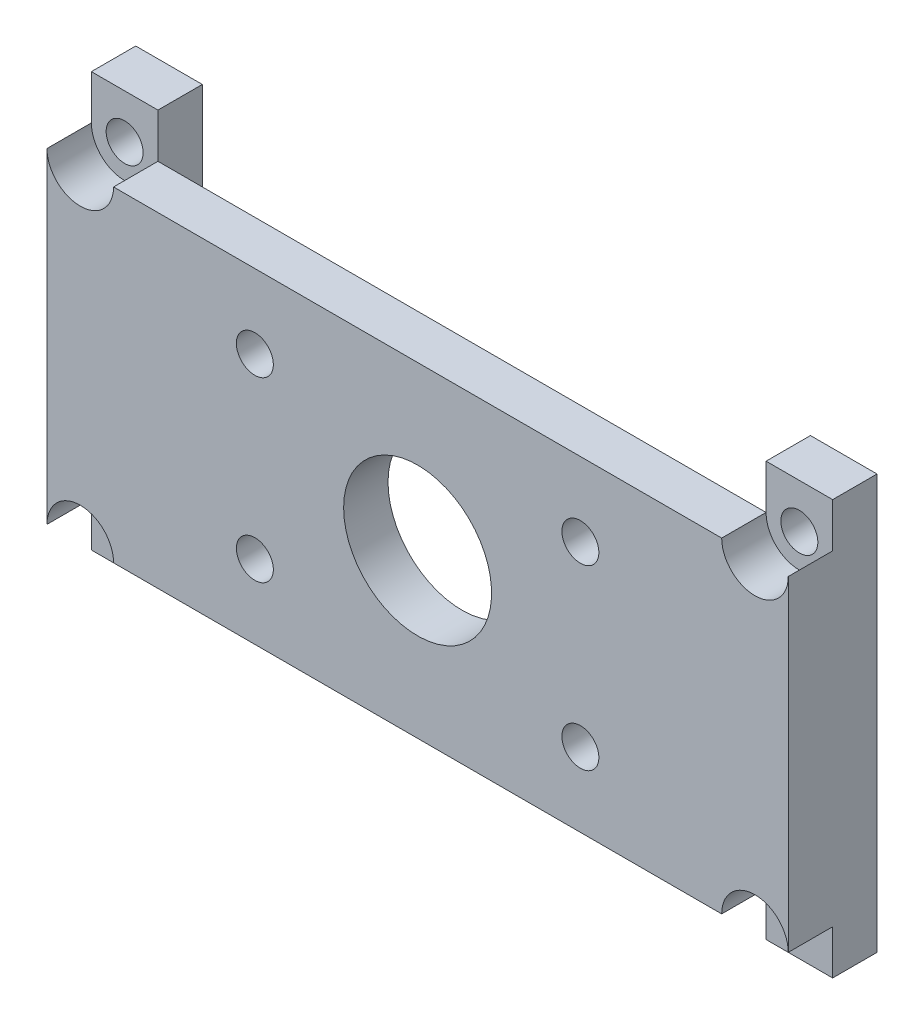
ISO-10303-21;
HEADER;
FILE_DESCRIPTION(('STEP AP214'),'2;1');
FILE_NAME('part.step','',(''),(''),'','','');
FILE_SCHEMA(('AUTOMOTIVE_DESIGN { 1 0 10303 214 1 1 1 1 }'));
ENDSEC;
DATA;
#1=APPLICATION_CONTEXT('core data for automotive mechanical design processes');
#2=APPLICATION_PROTOCOL_DEFINITION('international standard','automotive_design',2000,#1);
#3=PRODUCT_CONTEXT('',#1,'mechanical');
#4=PRODUCT('Part','Part','',(#3));
#5=PRODUCT_RELATED_PRODUCT_CATEGORY('part','',(#4));
#6=PRODUCT_DEFINITION_FORMATION('','',#4);
#7=PRODUCT_DEFINITION_CONTEXT('part definition',#1,'design');
#8=PRODUCT_DEFINITION('design','',#6,#7);
#9=PRODUCT_DEFINITION_SHAPE('','',#8);
#10=(LENGTH_UNIT() NAMED_UNIT(*) SI_UNIT(.MILLI.,.METRE.));
#11=(NAMED_UNIT(*) PLANE_ANGLE_UNIT() SI_UNIT($,.RADIAN.));
#12=(NAMED_UNIT(*) SI_UNIT($,.STERADIAN.) SOLID_ANGLE_UNIT());
#13=UNCERTAINTY_MEASURE_WITH_UNIT(LENGTH_MEASURE(1.E-05),#10,'distance_accuracy_value','');
#14=(GEOMETRIC_REPRESENTATION_CONTEXT(3) GLOBAL_UNCERTAINTY_ASSIGNED_CONTEXT((#13)) GLOBAL_UNIT_ASSIGNED_CONTEXT((#10,
#11,#12)) REPRESENTATION_CONTEXT('',''));
#15=CARTESIAN_POINT('',(0.,0.,0.));
#16=DIRECTION('',(0.,0.,1.));
#17=DIRECTION('',(1.,0.,0.));
#18=AXIS2_PLACEMENT_3D('',#15,#16,#17);
#19=CARTESIAN_POINT('',(47.85,3.,6.));
#20=DIRECTION('',(0.,0.,-1.));
#21=DIRECTION('',(-1.,0.,0.));
#22=AXIS2_PLACEMENT_3D('',#19,#20,#21);
#23=CYLINDRICAL_SURFACE('',#22,1.25);
#24=CARTESIAN_POINT('',(47.85,3.,0.));
#25=DIRECTION('',(0.,0.,-1.));
#26=DIRECTION('',(-1.,0.,0.));
#27=AXIS2_PLACEMENT_3D('',#24,#25,#26);
#28=CIRCLE('',#27,1.25);
#29=CARTESIAN_POINT('',(46.6,3.,0.));
#30=VERTEX_POINT('',#29);
#31=EDGE_CURVE('E300',#30,#30,#28,.T.);
#32=ORIENTED_EDGE('',*,*,#31,.T.);
#33=EDGE_LOOP('',(#32));
#34=FACE_BOUND('',#33,.T.);
#35=CARTESIAN_POINT('',(47.85,3.,3.));
#36=DIRECTION('',(0.,0.,-1.));
#37=DIRECTION('',(-1.,0.,0.));
#38=AXIS2_PLACEMENT_3D('',#35,#36,#37);
#39=CIRCLE('',#38,1.25);
#40=CARTESIAN_POINT('',(46.6,3.,3.));
#41=VERTEX_POINT('',#40);
#42=EDGE_CURVE('E313',#41,#41,#39,.T.);
#43=ORIENTED_EDGE('',*,*,#42,.F.);
#44=EDGE_LOOP('',(#43));
#45=FACE_BOUND('',#44,.T.);
#46=ADVANCED_FACE('F33',(#34,#45),#23,.F.);
#47=CARTESIAN_POINT('',(47.85,25.,6.));
#48=DIRECTION('',(0.,0.,-1.));
#49=DIRECTION('',(-1.,0.,0.));
#50=AXIS2_PLACEMENT_3D('',#47,#48,#49);
#51=CYLINDRICAL_SURFACE('',#50,1.25);
#52=CARTESIAN_POINT('',(47.85,25.,0.));
#53=DIRECTION('',(0.,0.,-1.));
#54=DIRECTION('',(-1.,0.,0.));
#55=AXIS2_PLACEMENT_3D('',#52,#53,#54);
#56=CIRCLE('',#55,1.25);
#57=CARTESIAN_POINT('',(46.6,25.,0.));
#58=VERTEX_POINT('',#57);
#59=EDGE_CURVE('E310',#58,#58,#56,.T.);
#60=ORIENTED_EDGE('',*,*,#59,.T.);
#61=EDGE_LOOP('',(#60));
#62=FACE_BOUND('',#61,.T.);
#63=CARTESIAN_POINT('',(47.85,25.,3.));
#64=DIRECTION('',(0.,0.,-1.));
#65=DIRECTION('',(-1.,0.,0.));
#66=AXIS2_PLACEMENT_3D('',#63,#64,#65);
#67=CIRCLE('',#66,1.25);
#68=CARTESIAN_POINT('',(46.6,25.,3.));
#69=VERTEX_POINT('',#68);
#70=EDGE_CURVE('E317',#69,#69,#67,.T.);
#71=ORIENTED_EDGE('',*,*,#70,.F.);
#72=EDGE_LOOP('',(#71));
#73=FACE_BOUND('',#72,.T.);
#74=ADVANCED_FACE('F242',(#62,#73),#51,.F.);
#75=CARTESIAN_POINT('',(0.,25.,6.));
#76=DIRECTION('',(0.,-1.,0.));
#77=DIRECTION('',(0.,0.,-1.));
#78=AXIS2_PLACEMENT_3D('',#75,#76,#77);
#79=PLANE('',#78);
#80=DIRECTION('',(-1.,0.,0.));
#81=VECTOR('',#80,1.);
#82=CARTESIAN_POINT('',(0.,25.,6.));
#83=LINE('',#82,#81);
#84=CARTESIAN_POINT('',(45.6,25.,6.));
#85=VERTEX_POINT('',#84);
#86=CARTESIAN_POINT('',(4.49999999999999,25.,6.));
#87=VERTEX_POINT('',#86);
#88=EDGE_CURVE('E362',#85,#87,#83,.T.);
#89=ORIENTED_EDGE('',*,*,#88,.F.);
#90=DIRECTION('',(0.,0.,1.));
#91=VECTOR('',#90,1.);
#92=CARTESIAN_POINT('',(45.6,25.,3.));
#93=LINE('',#92,#91);
#94=CARTESIAN_POINT('',(45.6,25.,3.));
#95=VERTEX_POINT('',#94);
#96=EDGE_CURVE('E174',#85,#95,#93,.F.);
#97=ORIENTED_EDGE('',*,*,#96,.T.);
#98=DIRECTION('',(-1.,0.,0.));
#99=VECTOR('',#98,1.);
#100=CARTESIAN_POINT('',(0.,25.,3.));
#101=LINE('',#100,#99);
#102=CARTESIAN_POINT('',(4.5,25.,3.));
#103=VERTEX_POINT('',#102);
#104=EDGE_CURVE('E179',#95,#103,#101,.T.);
#105=ORIENTED_EDGE('',*,*,#104,.T.);
#106=DIRECTION('',(0.,0.,1.));
#107=VECTOR('',#106,1.);
#108=CARTESIAN_POINT('',(4.49999999999999,25.,3.));
#109=LINE('',#108,#107);
#110=EDGE_CURVE('E156',#103,#87,#109,.T.);
#111=ORIENTED_EDGE('',*,*,#110,.T.);
#112=EDGE_LOOP('',(#89,#97,#105,#111));
#113=FACE_BOUND('',#112,.T.);
#114=ADVANCED_FACE('F180',(#113),#79,.F.);
#115=CARTESIAN_POINT('',(0.,0.,3.));
#116=DIRECTION('',(0.,0.,1.));
#117=DIRECTION('',(1.,0.,0.));
#118=AXIS2_PLACEMENT_3D('',#115,#116,#117);
#119=PLANE('',#118);
#120=CARTESIAN_POINT('',(14.05,8.,3.));
#121=DIRECTION('',(0.,0.,-1.));
#122=DIRECTION('',(-1.,0.,0.));
#123=AXIS2_PLACEMENT_3D('',#120,#121,#122);
#124=CIRCLE('',#123,1.25);
#125=CARTESIAN_POINT('',(12.8,8.,3.));
#126=VERTEX_POINT('',#125);
#127=EDGE_CURVE('E403',#126,#126,#124,.T.);
#128=ORIENTED_EDGE('',*,*,#127,.F.);
#129=EDGE_LOOP('',(#128));
#130=FACE_BOUND('',#129,.T.);
#131=CARTESIAN_POINT('',(36.05,8.,3.));
#132=DIRECTION('',(0.,0.,-1.));
#133=DIRECTION('',(1.,0.,0.));
#134=AXIS2_PLACEMENT_3D('',#131,#132,#133);
#135=CIRCLE('',#134,1.25);
#136=CARTESIAN_POINT('',(37.3,8.,3.));
#137=VERTEX_POINT('',#136);
#138=EDGE_CURVE('E420',#137,#137,#135,.T.);
#139=ORIENTED_EDGE('',*,*,#138,.F.);
#140=EDGE_LOOP('',(#139));
#141=FACE_BOUND('',#140,.T.);
#142=CARTESIAN_POINT('',(14.05,20.,3.));
#143=DIRECTION('',(0.,0.,-1.));
#144=DIRECTION('',(1.,0.,0.));
#145=AXIS2_PLACEMENT_3D('',#142,#143,#144);
#146=CIRCLE('',#145,1.25);
#147=CARTESIAN_POINT('',(15.3,20.,3.));
#148=VERTEX_POINT('',#147);
#149=EDGE_CURVE('E414',#148,#148,#146,.T.);
#150=ORIENTED_EDGE('',*,*,#149,.F.);
#151=EDGE_LOOP('',(#150));
#152=FACE_BOUND('',#151,.T.);
#153=CARTESIAN_POINT('',(36.05,20.,3.));
#154=DIRECTION('',(0.,0.,-1.));
#155=DIRECTION('',(-1.,0.,0.));
#156=AXIS2_PLACEMENT_3D('',#153,#154,#155);
#157=CIRCLE('',#156,1.25);
#158=CARTESIAN_POINT('',(34.8,20.,3.));
#159=VERTEX_POINT('',#158);
#160=EDGE_CURVE('E408',#159,#159,#157,.T.);
#161=ORIENTED_EDGE('',*,*,#160,.F.);
#162=EDGE_LOOP('',(#161));
#163=FACE_BOUND('',#162,.T.);
#164=CARTESIAN_POINT('',(25.05,14.,3.));
#165=DIRECTION('',(0.,0.,-1.));
#166=DIRECTION('',(-1.,0.,0.));
#167=AXIS2_PLACEMENT_3D('',#164,#165,#166);
#168=CIRCLE('',#167,5.);
#169=CARTESIAN_POINT('',(20.05,14.,3.));
#170=VERTEX_POINT('',#169);
#171=EDGE_CURVE('E407',#170,#170,#168,.T.);
#172=ORIENTED_EDGE('',*,*,#171,.F.);
#173=EDGE_LOOP('',(#172));
#174=FACE_BOUND('',#173,.T.);
#175=DIRECTION('',(0.,1.,0.));
#176=VECTOR('',#175,1.);
#177=CARTESIAN_POINT('',(45.6,28.,3.));
#178=LINE('',#177,#176);
#179=CARTESIAN_POINT('',(45.6,3.,3.));
#180=VERTEX_POINT('',#179);
#181=EDGE_CURVE('E341',#180,#95,#178,.T.);
#182=ORIENTED_EDGE('',*,*,#181,.F.);
#183=DIRECTION('',(1.,0.,0.));
#184=VECTOR('',#183,1.);
#185=CARTESIAN_POINT('',(0.,3.,3.));
#186=LINE('',#185,#184);
#187=CARTESIAN_POINT('',(4.5,3.,3.));
#188=VERTEX_POINT('',#187);
#189=EDGE_CURVE('E186',#188,#180,#186,.T.);
#190=ORIENTED_EDGE('',*,*,#189,.F.);
#191=DIRECTION('',(0.,1.,0.));
#192=VECTOR('',#191,1.);
#193=CARTESIAN_POINT('',(4.5,0.,3.));
#194=LINE('',#193,#192);
#195=EDGE_CURVE('E191',#188,#103,#194,.T.);
#196=ORIENTED_EDGE('',*,*,#195,.T.);
#197=ORIENTED_EDGE('',*,*,#104,.F.);
#198=EDGE_LOOP('',(#182,#190,#196,#197));
#199=FACE_BOUND('',#198,.T.);
#200=ADVANCED_FACE('F197',(#130,#141,#152,#163,#174,#199),#119,.F.);
#201=CARTESIAN_POINT('',(0.,0.,3.));
#202=DIRECTION('',(0.,0.,-1.));
#203=DIRECTION('',(-1.,0.,0.));
#204=AXIS2_PLACEMENT_3D('',#201,#202,#203);
#205=PLANE('',#204);
#206=CARTESIAN_POINT('',(2.25,25.,3.));
#207=DIRECTION('',(0.,0.,1.));
#208=DIRECTION('',(1.,0.,0.));
#209=AXIS2_PLACEMENT_3D('',#206,#207,#208);
#210=CIRCLE('',#209,1.25);
#211=CARTESIAN_POINT('',(3.5,25.,3.));
#212=VERTEX_POINT('',#211);
#213=EDGE_CURVE('E295',#212,#212,#210,.T.);
#214=ORIENTED_EDGE('',*,*,#213,.F.);
#215=EDGE_LOOP('',(#214));
#216=FACE_BOUND('',#215,.T.);
#217=DIRECTION('',(0.,-1.,0.));
#218=VECTOR('',#217,1.);
#219=CARTESIAN_POINT('',(0.,0.,3.));
#220=LINE('',#219,#218);
#221=CARTESIAN_POINT('',(0.,28.,3.));
#222=VERTEX_POINT('',#221);
#223=CARTESIAN_POINT('',(0.,25.,3.));
#224=VERTEX_POINT('',#223);
#225=EDGE_CURVE('E172',#222,#224,#220,.T.);
#226=ORIENTED_EDGE('',*,*,#225,.T.);
#227=CARTESIAN_POINT('',(2.25,25.,3.));
#228=DIRECTION('',(0.,0.,1.));
#229=DIRECTION('',(1.,0.,0.));
#230=AXIS2_PLACEMENT_3D('',#227,#228,#229);
#231=CIRCLE('',#230,2.25);
#232=EDGE_CURVE('E159',#224,#103,#231,.T.);
#233=ORIENTED_EDGE('',*,*,#232,.T.);
#234=CARTESIAN_POINT('',(4.49999999999999,28.,3.));
#235=VERTEX_POINT('',#234);
#236=EDGE_CURVE('E170',#103,#235,#194,.T.);
#237=ORIENTED_EDGE('',*,*,#236,.T.);
#238=DIRECTION('',(-1.,0.,0.));
#239=VECTOR('',#238,1.);
#240=CARTESIAN_POINT('',(0.,28.,3.));
#241=LINE('',#240,#239);
#242=EDGE_CURVE('E50',#235,#222,#241,.T.);
#243=ORIENTED_EDGE('',*,*,#242,.T.);
#244=EDGE_LOOP('',(#226,#233,#237,#243));
#245=FACE_BOUND('',#244,.T.);
#246=ADVANCED_FACE('F168',(#216,#245),#205,.F.);
#247=CARTESIAN_POINT('',(4.5,0.,3.));
#248=VERTEX_POINT('',#247);
#249=EDGE_CURVE('E196',#248,#188,#194,.T.);
#250=ORIENTED_EDGE('',*,*,#249,.T.);
#251=CARTESIAN_POINT('',(2.25,3.,3.));
#252=DIRECTION('',(0.,0.,1.));
#253=DIRECTION('',(1.,0.,0.));
#254=AXIS2_PLACEMENT_3D('',#251,#252,#253);
#255=CIRCLE('',#254,2.25);
#256=CARTESIAN_POINT('',(0.,3.,3.));
#257=VERTEX_POINT('',#256);
#258=EDGE_CURVE('E175',#188,#257,#255,.T.);
#259=ORIENTED_EDGE('',*,*,#258,.T.);
#260=CARTESIAN_POINT('',(0.,0.,3.));
#261=VERTEX_POINT('',#260);
#262=EDGE_CURVE('E82',#257,#261,#220,.T.);
#263=ORIENTED_EDGE('',*,*,#262,.T.);
#264=DIRECTION('',(1.,0.,0.));
#265=VECTOR('',#264,1.);
#266=CARTESIAN_POINT('',(0.,0.,3.));
#267=LINE('',#266,#265);
#268=EDGE_CURVE('E194',#261,#248,#267,.T.);
#269=ORIENTED_EDGE('',*,*,#268,.T.);
#270=EDGE_LOOP('',(#250,#259,#263,#269));
#271=FACE_BOUND('',#270,.T.);
#272=CARTESIAN_POINT('',(2.25,3.,3.));
#273=DIRECTION('',(0.,0.,1.));
#274=DIRECTION('',(1.,0.,0.));
#275=AXIS2_PLACEMENT_3D('',#272,#273,#274);
#276=CIRCLE('',#275,1.25);
#277=CARTESIAN_POINT('',(3.5,3.,3.));
#278=VERTEX_POINT('',#277);
#279=EDGE_CURVE('E303',#278,#278,#276,.T.);
#280=ORIENTED_EDGE('',*,*,#279,.F.);
#281=EDGE_LOOP('',(#280));
#282=FACE_BOUND('',#281,.T.);
#283=ADVANCED_FACE('F288',(#271,#282),#205,.F.);
#284=CARTESIAN_POINT('',(0.,0.,3.));
#285=DIRECTION('',(1.,0.,0.));
#286=DIRECTION('',(0.,0.,-1.));
#287=AXIS2_PLACEMENT_3D('',#284,#285,#286);
#288=PLANE('',#287);
#289=DIRECTION('',(0.,-1.,0.));
#290=VECTOR('',#289,1.);
#291=CARTESIAN_POINT('',(0.,0.,0.));
#292=LINE('',#291,#290);
#293=CARTESIAN_POINT('',(0.,28.,0.));
#294=VERTEX_POINT('',#293);
#295=CARTESIAN_POINT('',(0.,0.,0.));
#296=VERTEX_POINT('',#295);
#297=EDGE_CURVE('E205',#294,#296,#292,.T.);
#298=ORIENTED_EDGE('',*,*,#297,.T.);
#299=DIRECTION('',(0.,0.,-1.));
#300=VECTOR('',#299,1.);
#301=CARTESIAN_POINT('',(0.,0.,3.));
#302=LINE('',#301,#300);
#303=EDGE_CURVE('E42',#261,#296,#302,.T.);
#304=ORIENTED_EDGE('',*,*,#303,.F.);
#305=ORIENTED_EDGE('',*,*,#262,.F.);
#306=DIRECTION('',(0.,0.,-1.));
#307=VECTOR('',#306,1.);
#308=CARTESIAN_POINT('',(0.,3.,6.));
#309=LINE('',#308,#307);
#310=CARTESIAN_POINT('',(0.,3.,6.));
#311=VERTEX_POINT('',#310);
#312=EDGE_CURVE('E209',#311,#257,#309,.T.);
#313=ORIENTED_EDGE('',*,*,#312,.F.);
#314=DIRECTION('',(0.,-1.,0.));
#315=VECTOR('',#314,1.);
#316=CARTESIAN_POINT('',(0.,25.,6.));
#317=LINE('',#316,#315);
#318=CARTESIAN_POINT('',(0.,25.,6.));
#319=VERTEX_POINT('',#318);
#320=EDGE_CURVE('E185',#319,#311,#317,.T.);
#321=ORIENTED_EDGE('',*,*,#320,.F.);
#322=DIRECTION('',(0.,0.,-1.));
#323=VECTOR('',#322,1.);
#324=CARTESIAN_POINT('',(0.,25.,6.));
#325=LINE('',#324,#323);
#326=EDGE_CURVE('E364',#319,#224,#325,.T.);
#327=ORIENTED_EDGE('',*,*,#326,.T.);
#328=ORIENTED_EDGE('',*,*,#225,.F.);
#329=DIRECTION('',(0.,0.,-1.));
#330=VECTOR('',#329,1.);
#331=CARTESIAN_POINT('',(0.,28.,3.));
#332=LINE('',#331,#330);
#333=EDGE_CURVE('E204',#222,#294,#332,.T.);
#334=ORIENTED_EDGE('',*,*,#333,.T.);
#335=EDGE_LOOP('',(#298,#304,#305,#313,#321,#327,#328,#334));
#336=FACE_BOUND('',#335,.T.);
#337=ADVANCED_FACE('F35',(#336),#288,.F.);
#338=CARTESIAN_POINT('',(0.,0.,3.));
#339=DIRECTION('',(0.,1.,0.));
#340=DIRECTION('',(0.,0.,1.));
#341=AXIS2_PLACEMENT_3D('',#338,#339,#340);
#342=PLANE('',#341);
#343=DIRECTION('',(1.,0.,0.));
#344=VECTOR('',#343,1.);
#345=CARTESIAN_POINT('',(0.,0.,0.));
#346=LINE('',#345,#344);
#347=CARTESIAN_POINT('',(4.5,0.,0.));
#348=VERTEX_POINT('',#347);
#349=EDGE_CURVE('E208',#296,#348,#346,.T.);
#350=ORIENTED_EDGE('',*,*,#349,.T.);
#351=DIRECTION('',(0.,0.,-1.));
#352=VECTOR('',#351,1.);
#353=CARTESIAN_POINT('',(4.5,0.,3.));
#354=LINE('',#353,#352);
#355=EDGE_CURVE('E215',#248,#348,#354,.T.);
#356=ORIENTED_EDGE('',*,*,#355,.F.);
#357=ORIENTED_EDGE('',*,*,#268,.F.);
#358=ORIENTED_EDGE('',*,*,#303,.T.);
#359=EDGE_LOOP('',(#350,#356,#357,#358));
#360=FACE_BOUND('',#359,.T.);
#361=ADVANCED_FACE('F219',(#360),#342,.F.);
#362=CARTESIAN_POINT('',(4.5,0.,3.));
#363=DIRECTION('',(-1.,0.,0.));
#364=DIRECTION('',(0.,-1.,0.));
#365=AXIS2_PLACEMENT_3D('',#362,#363,#364);
#366=PLANE('',#365);
#367=DIRECTION('',(0.,1.,0.));
#368=VECTOR('',#367,1.);
#369=CARTESIAN_POINT('',(4.5,0.,0.));
#370=LINE('',#369,#368);
#371=CARTESIAN_POINT('',(4.49999999999999,28.,0.));
#372=VERTEX_POINT('',#371);
#373=EDGE_CURVE('E68',#348,#372,#370,.T.);
#374=ORIENTED_EDGE('',*,*,#373,.T.);
#375=DIRECTION('',(0.,0.,-1.));
#376=VECTOR('',#375,1.);
#377=CARTESIAN_POINT('',(4.49999999999999,28.,3.));
#378=LINE('',#377,#376);
#379=EDGE_CURVE('E193',#235,#372,#378,.T.);
#380=ORIENTED_EDGE('',*,*,#379,.F.);
#381=ORIENTED_EDGE('',*,*,#236,.F.);
#382=ORIENTED_EDGE('',*,*,#195,.F.);
#383=ORIENTED_EDGE('',*,*,#249,.F.);
#384=ORIENTED_EDGE('',*,*,#355,.T.);
#385=EDGE_LOOP('',(#374,#380,#381,#382,#383,#384));
#386=FACE_BOUND('',#385,.T.);
#387=ADVANCED_FACE('F189',(#386),#366,.F.);
#388=CARTESIAN_POINT('',(0.,28.,3.));
#389=DIRECTION('',(0.,-1.,0.));
#390=DIRECTION('',(0.,0.,-1.));
#391=AXIS2_PLACEMENT_3D('',#388,#389,#390);
#392=PLANE('',#391);
#393=DIRECTION('',(-1.,0.,0.));
#394=VECTOR('',#393,1.);
#395=CARTESIAN_POINT('',(0.,28.,0.));
#396=LINE('',#395,#394);
#397=EDGE_CURVE('E74',#372,#294,#396,.T.);
#398=ORIENTED_EDGE('',*,*,#397,.T.);
#399=ORIENTED_EDGE('',*,*,#333,.F.);
#400=ORIENTED_EDGE('',*,*,#242,.F.);
#401=ORIENTED_EDGE('',*,*,#379,.T.);
#402=EDGE_LOOP('',(#398,#399,#400,#401));
#403=FACE_BOUND('',#402,.T.);
#404=ADVANCED_FACE('F227',(#403),#392,.F.);
#405=CARTESIAN_POINT('',(0.,0.,0.));
#406=DIRECTION('',(0.,0.,-1.));
#407=DIRECTION('',(-1.,0.,0.));
#408=AXIS2_PLACEMENT_3D('',#405,#406,#407);
#409=PLANE('',#408);
#410=CARTESIAN_POINT('',(2.25,25.,0.));
#411=DIRECTION('',(0.,0.,1.));
#412=DIRECTION('',(1.,0.,0.));
#413=AXIS2_PLACEMENT_3D('',#410,#411,#412);
#414=CIRCLE('',#413,1.25);
#415=CARTESIAN_POINT('',(3.5,25.,0.));
#416=VERTEX_POINT('',#415);
#417=EDGE_CURVE('E297',#416,#416,#414,.T.);
#418=ORIENTED_EDGE('',*,*,#417,.T.);
#419=EDGE_LOOP('',(#418));
#420=FACE_BOUND('',#419,.T.);
#421=CARTESIAN_POINT('',(2.25,3.,0.));
#422=DIRECTION('',(0.,0.,1.));
#423=DIRECTION('',(1.,0.,0.));
#424=AXIS2_PLACEMENT_3D('',#421,#422,#423);
#425=CIRCLE('',#424,1.25);
#426=CARTESIAN_POINT('',(3.5,3.,0.));
#427=VERTEX_POINT('',#426);
#428=EDGE_CURVE('E298',#427,#427,#425,.T.);
#429=ORIENTED_EDGE('',*,*,#428,.T.);
#430=EDGE_LOOP('',(#429));
#431=FACE_BOUND('',#430,.T.);
#432=ORIENTED_EDGE('',*,*,#297,.F.);
#433=ORIENTED_EDGE('',*,*,#397,.F.);
#434=ORIENTED_EDGE('',*,*,#373,.F.);
#435=ORIENTED_EDGE('',*,*,#349,.F.);
#436=EDGE_LOOP('',(#432,#433,#434,#435));
#437=FACE_BOUND('',#436,.T.);
#438=ADVANCED_FACE('F224',(#420,#431,#437),#409,.T.);
#439=CARTESIAN_POINT('',(0.,3.,6.));
#440=DIRECTION('',(0.,1.,0.));
#441=DIRECTION('',(0.,0.,1.));
#442=AXIS2_PLACEMENT_3D('',#439,#440,#441);
#443=PLANE('',#442);
#444=DIRECTION('',(1.,0.,0.));
#445=VECTOR('',#444,1.);
#446=CARTESIAN_POINT('',(0.,3.,6.));
#447=LINE('',#446,#445);
#448=CARTESIAN_POINT('',(4.5,3.,6.));
#449=VERTEX_POINT('',#448);
#450=CARTESIAN_POINT('',(45.6,3.,6.));
#451=VERTEX_POINT('',#450);
#452=EDGE_CURVE('E356',#449,#451,#447,.T.);
#453=ORIENTED_EDGE('',*,*,#452,.F.);
#454=DIRECTION('',(0.,0.,1.));
#455=VECTOR('',#454,1.);
#456=CARTESIAN_POINT('',(4.5,3.,3.));
#457=LINE('',#456,#455);
#458=EDGE_CURVE('E165',#449,#188,#457,.F.);
#459=ORIENTED_EDGE('',*,*,#458,.T.);
#460=ORIENTED_EDGE('',*,*,#189,.T.);
#461=DIRECTION('',(0.,0.,1.));
#462=VECTOR('',#461,1.);
#463=CARTESIAN_POINT('',(45.6,3.,3.));
#464=LINE('',#463,#462);
#465=EDGE_CURVE('E166',#180,#451,#464,.T.);
#466=ORIENTED_EDGE('',*,*,#465,.T.);
#467=EDGE_LOOP('',(#453,#459,#460,#466));
#468=FACE_BOUND('',#467,.T.);
#469=ADVANCED_FACE('F226',(#468),#443,.F.);
#470=CARTESIAN_POINT('',(50.1,25.,6.));
#471=DIRECTION('',(-1.,0.,0.));
#472=DIRECTION('',(0.,0.,1.));
#473=AXIS2_PLACEMENT_3D('',#470,#471,#472);
#474=PLANE('',#473);
#475=DIRECTION('',(0.,0.,-1.));
#476=VECTOR('',#475,1.);
#477=CARTESIAN_POINT('',(50.1,3.,6.));
#478=LINE('',#477,#476);
#479=CARTESIAN_POINT('',(50.1,3.,6.));
#480=VERTEX_POINT('',#479);
#481=CARTESIAN_POINT('',(50.1,3.,3.));
#482=VERTEX_POINT('',#481);
#483=EDGE_CURVE('E369',#480,#482,#478,.T.);
#484=ORIENTED_EDGE('',*,*,#483,.T.);
#485=DIRECTION('',(0.,-1.,0.));
#486=VECTOR('',#485,1.);
#487=CARTESIAN_POINT('',(50.1,28.,3.));
#488=LINE('',#487,#486);
#489=CARTESIAN_POINT('',(50.1,0.,3.));
#490=VERTEX_POINT('',#489);
#491=EDGE_CURVE('E320',#482,#490,#488,.T.);
#492=ORIENTED_EDGE('',*,*,#491,.T.);
#493=DIRECTION('',(0.,0.,1.));
#494=VECTOR('',#493,1.);
#495=CARTESIAN_POINT('',(50.1,0.,0.));
#496=LINE('',#495,#494);
#497=CARTESIAN_POINT('',(50.1,0.,0.));
#498=VERTEX_POINT('',#497);
#499=EDGE_CURVE('E351',#498,#490,#496,.T.);
#500=ORIENTED_EDGE('',*,*,#499,.F.);
#501=DIRECTION('',(0.,-1.,0.));
#502=VECTOR('',#501,1.);
#503=CARTESIAN_POINT('',(50.1,28.,0.));
#504=LINE('',#503,#502);
#505=CARTESIAN_POINT('',(50.1,28.,0.));
#506=VERTEX_POINT('',#505);
#507=EDGE_CURVE('E321',#506,#498,#504,.T.);
#508=ORIENTED_EDGE('',*,*,#507,.F.);
#509=DIRECTION('',(0.,0.,1.));
#510=VECTOR('',#509,1.);
#511=CARTESIAN_POINT('',(50.1,28.,0.));
#512=LINE('',#511,#510);
#513=CARTESIAN_POINT('',(50.1,28.,3.));
#514=VERTEX_POINT('',#513);
#515=EDGE_CURVE('E331',#506,#514,#512,.T.);
#516=ORIENTED_EDGE('',*,*,#515,.T.);
#517=CARTESIAN_POINT('',(50.1,25.,3.));
#518=VERTEX_POINT('',#517);
#519=EDGE_CURVE('E332',#514,#518,#488,.T.);
#520=ORIENTED_EDGE('',*,*,#519,.T.);
#521=DIRECTION('',(0.,0.,-1.));
#522=VECTOR('',#521,1.);
#523=CARTESIAN_POINT('',(50.1,25.,6.));
#524=LINE('',#523,#522);
#525=CARTESIAN_POINT('',(50.1,25.,6.));
#526=VERTEX_POINT('',#525);
#527=EDGE_CURVE('E367',#526,#518,#524,.T.);
#528=ORIENTED_EDGE('',*,*,#527,.F.);
#529=DIRECTION('',(0.,1.,0.));
#530=VECTOR('',#529,1.);
#531=CARTESIAN_POINT('',(50.1,25.,6.));
#532=LINE('',#531,#530);
#533=EDGE_CURVE('E359',#480,#526,#532,.T.);
#534=ORIENTED_EDGE('',*,*,#533,.F.);
#535=EDGE_LOOP('',(#484,#492,#500,#508,#516,#520,#528,#534));
#536=FACE_BOUND('',#535,.T.);
#537=ADVANCED_FACE('F234',(#536),#474,.F.);
#538=CARTESIAN_POINT('',(0.,0.,6.));
#539=DIRECTION('',(0.,0.,1.));
#540=DIRECTION('',(1.,0.,0.));
#541=AXIS2_PLACEMENT_3D('',#538,#539,#540);
#542=PLANE('',#541);
#543=CARTESIAN_POINT('',(2.25,3.,6.));
#544=DIRECTION('',(0.,0.,1.));
#545=DIRECTION('',(1.,0.,0.));
#546=AXIS2_PLACEMENT_3D('',#543,#544,#545);
#547=CIRCLE('',#546,2.25);
#548=EDGE_CURVE('E375',#449,#311,#547,.T.);
#549=ORIENTED_EDGE('',*,*,#548,.F.);
#550=ORIENTED_EDGE('',*,*,#452,.T.);
#551=CARTESIAN_POINT('',(47.85,3.,6.));
#552=DIRECTION('',(0.,0.,1.));
#553=DIRECTION('',(1.,0.,0.));
#554=AXIS2_PLACEMENT_3D('',#551,#552,#553);
#555=CIRCLE('',#554,2.25);
#556=EDGE_CURVE('E396',#480,#451,#555,.T.);
#557=ORIENTED_EDGE('',*,*,#556,.F.);
#558=ORIENTED_EDGE('',*,*,#533,.T.);
#559=CARTESIAN_POINT('',(47.85,25.,6.));
#560=DIRECTION('',(0.,0.,1.));
#561=DIRECTION('',(1.,0.,0.));
#562=AXIS2_PLACEMENT_3D('',#559,#560,#561);
#563=CIRCLE('',#562,2.25000000000001);
#564=EDGE_CURVE('E386',#85,#526,#563,.T.);
#565=ORIENTED_EDGE('',*,*,#564,.F.);
#566=ORIENTED_EDGE('',*,*,#88,.T.);
#567=CARTESIAN_POINT('',(2.25,25.,6.));
#568=DIRECTION('',(0.,0.,1.));
#569=DIRECTION('',(1.,0.,0.));
#570=AXIS2_PLACEMENT_3D('',#567,#568,#569);
#571=CIRCLE('',#570,2.25);
#572=EDGE_CURVE('E11',#319,#87,#571,.T.);
#573=ORIENTED_EDGE('',*,*,#572,.F.);
#574=ORIENTED_EDGE('',*,*,#320,.T.);
#575=EDGE_LOOP('',(#549,#550,#557,#558,#565,#566,#573,#574));
#576=FACE_BOUND('',#575,.T.);
#577=CARTESIAN_POINT('',(14.05,8.,6.));
#578=DIRECTION('',(0.,0.,-1.));
#579=DIRECTION('',(-1.,0.,0.));
#580=AXIS2_PLACEMENT_3D('',#577,#578,#579);
#581=CIRCLE('',#580,1.25);
#582=CARTESIAN_POINT('',(12.8,8.,6.));
#583=VERTEX_POINT('',#582);
#584=EDGE_CURVE('E423',#583,#583,#581,.T.);
#585=ORIENTED_EDGE('',*,*,#584,.T.);
#586=EDGE_LOOP('',(#585));
#587=FACE_BOUND('',#586,.T.);
#588=CARTESIAN_POINT('',(36.05,8.,6.));
#589=DIRECTION('',(0.,0.,-1.));
#590=DIRECTION('',(1.,0.,0.));
#591=AXIS2_PLACEMENT_3D('',#588,#589,#590);
#592=CIRCLE('',#591,1.25);
#593=CARTESIAN_POINT('',(37.3,8.,6.));
#594=VERTEX_POINT('',#593);
#595=EDGE_CURVE('E417',#594,#594,#592,.T.);
#596=ORIENTED_EDGE('',*,*,#595,.T.);
#597=EDGE_LOOP('',(#596));
#598=FACE_BOUND('',#597,.T.);
#599=CARTESIAN_POINT('',(14.05,20.,6.));
#600=DIRECTION('',(0.,0.,-1.));
#601=DIRECTION('',(1.,0.,0.));
#602=AXIS2_PLACEMENT_3D('',#599,#600,#601);
#603=CIRCLE('',#602,1.25);
#604=CARTESIAN_POINT('',(15.3,20.,6.));
#605=VERTEX_POINT('',#604);
#606=EDGE_CURVE('E411',#605,#605,#603,.T.);
#607=ORIENTED_EDGE('',*,*,#606,.T.);
#608=EDGE_LOOP('',(#607));
#609=FACE_BOUND('',#608,.T.);
#610=CARTESIAN_POINT('',(36.05,20.,6.));
#611=DIRECTION('',(0.,0.,-1.));
#612=DIRECTION('',(-1.,0.,0.));
#613=AXIS2_PLACEMENT_3D('',#610,#611,#612);
#614=CIRCLE('',#613,1.25);
#615=CARTESIAN_POINT('',(34.8,20.,6.));
#616=VERTEX_POINT('',#615);
#617=EDGE_CURVE('E404',#616,#616,#614,.T.);
#618=ORIENTED_EDGE('',*,*,#617,.T.);
#619=EDGE_LOOP('',(#618));
#620=FACE_BOUND('',#619,.T.);
#621=CARTESIAN_POINT('',(25.05,14.,6.));
#622=DIRECTION('',(0.,0.,-1.));
#623=DIRECTION('',(-1.,0.,0.));
#624=AXIS2_PLACEMENT_3D('',#621,#622,#623);
#625=CIRCLE('',#624,5.);
#626=CARTESIAN_POINT('',(20.05,14.,6.));
#627=VERTEX_POINT('',#626);
#628=EDGE_CURVE('E309',#627,#627,#625,.T.);
#629=ORIENTED_EDGE('',*,*,#628,.T.);
#630=EDGE_LOOP('',(#629));
#631=FACE_BOUND('',#630,.T.);
#632=ADVANCED_FACE('F264',(#576,#587,#598,#609,#620,#631),#542,.T.);
#633=CARTESIAN_POINT('',(0.,0.,3.));
#634=DIRECTION('',(0.,0.,-1.));
#635=DIRECTION('',(-1.,0.,0.));
#636=AXIS2_PLACEMENT_3D('',#633,#634,#635);
#637=PLANE('',#636);
#638=ORIENTED_EDGE('',*,*,#42,.T.);
#639=EDGE_LOOP('',(#638));
#640=FACE_BOUND('',#639,.T.);
#641=ORIENTED_EDGE('',*,*,#491,.F.);
#642=CARTESIAN_POINT('',(47.85,3.,3.));
#643=DIRECTION('',(0.,0.,1.));
#644=DIRECTION('',(1.,0.,0.));
#645=AXIS2_PLACEMENT_3D('',#642,#643,#644);
#646=CIRCLE('',#645,2.25);
#647=EDGE_CURVE('E391',#482,#180,#646,.T.);
#648=ORIENTED_EDGE('',*,*,#647,.T.);
#649=CARTESIAN_POINT('',(45.6,0.,3.));
#650=VERTEX_POINT('',#649);
#651=EDGE_CURVE('E338',#650,#180,#178,.T.);
#652=ORIENTED_EDGE('',*,*,#651,.F.);
#653=DIRECTION('',(-1.,0.,0.));
#654=VECTOR('',#653,1.);
#655=CARTESIAN_POINT('',(50.1,0.,3.));
#656=LINE('',#655,#654);
#657=EDGE_CURVE('E335',#490,#650,#656,.T.);
#658=ORIENTED_EDGE('',*,*,#657,.F.);
#659=EDGE_LOOP('',(#641,#648,#652,#658));
#660=FACE_BOUND('',#659,.T.);
#661=ADVANCED_FACE('F260',(#640,#660),#637,.F.);
#662=CARTESIAN_POINT('',(45.6,28.,3.));
#663=VERTEX_POINT('',#662);
#664=EDGE_CURVE('E337',#95,#663,#178,.T.);
#665=ORIENTED_EDGE('',*,*,#664,.F.);
#666=CARTESIAN_POINT('',(47.85,25.,3.));
#667=DIRECTION('',(0.,0.,1.));
#668=DIRECTION('',(1.,0.,0.));
#669=AXIS2_PLACEMENT_3D('',#666,#667,#668);
#670=CIRCLE('',#669,2.25000000000001);
#671=EDGE_CURVE('E382',#95,#518,#670,.T.);
#672=ORIENTED_EDGE('',*,*,#671,.T.);
#673=ORIENTED_EDGE('',*,*,#519,.F.);
#674=DIRECTION('',(1.,0.,0.));
#675=VECTOR('',#674,1.);
#676=CARTESIAN_POINT('',(50.1,28.,3.));
#677=LINE('',#676,#675);
#678=EDGE_CURVE('E325',#663,#514,#677,.T.);
#679=ORIENTED_EDGE('',*,*,#678,.F.);
#680=EDGE_LOOP('',(#665,#672,#673,#679));
#681=FACE_BOUND('',#680,.T.);
#682=ORIENTED_EDGE('',*,*,#70,.T.);
#683=EDGE_LOOP('',(#682));
#684=FACE_BOUND('',#683,.T.);
#685=ADVANCED_FACE('F263',(#681,#684),#637,.F.);
#686=CARTESIAN_POINT('',(50.1,0.,0.));
#687=DIRECTION('',(0.,1.,0.));
#688=DIRECTION('',(0.,0.,1.));
#689=AXIS2_PLACEMENT_3D('',#686,#687,#688);
#690=PLANE('',#689);
#691=ORIENTED_EDGE('',*,*,#657,.T.);
#692=DIRECTION('',(0.,0.,1.));
#693=VECTOR('',#692,1.);
#694=CARTESIAN_POINT('',(45.6,0.,0.));
#695=LINE('',#694,#693);
#696=CARTESIAN_POINT('',(45.6,0.,0.));
#697=VERTEX_POINT('',#696);
#698=EDGE_CURVE('E348',#697,#650,#695,.T.);
#699=ORIENTED_EDGE('',*,*,#698,.F.);
#700=DIRECTION('',(-1.,0.,0.));
#701=VECTOR('',#700,1.);
#702=CARTESIAN_POINT('',(50.1,0.,0.));
#703=LINE('',#702,#701);
#704=EDGE_CURVE('E324',#498,#697,#703,.T.);
#705=ORIENTED_EDGE('',*,*,#704,.F.);
#706=ORIENTED_EDGE('',*,*,#499,.T.);
#707=EDGE_LOOP('',(#691,#699,#705,#706));
#708=FACE_BOUND('',#707,.T.);
#709=ADVANCED_FACE('F272',(#708),#690,.F.);
#710=CARTESIAN_POINT('',(45.6,28.,0.));
#711=DIRECTION('',(1.,0.,0.));
#712=DIRECTION('',(0.,1.,0.));
#713=AXIS2_PLACEMENT_3D('',#710,#711,#712);
#714=PLANE('',#713);
#715=ORIENTED_EDGE('',*,*,#651,.T.);
#716=ORIENTED_EDGE('',*,*,#181,.T.);
#717=ORIENTED_EDGE('',*,*,#664,.T.);
#718=DIRECTION('',(0.,0.,1.));
#719=VECTOR('',#718,1.);
#720=CARTESIAN_POINT('',(45.6,28.,0.));
#721=LINE('',#720,#719);
#722=CARTESIAN_POINT('',(45.6,28.,0.));
#723=VERTEX_POINT('',#722);
#724=EDGE_CURVE('E345',#723,#663,#721,.T.);
#725=ORIENTED_EDGE('',*,*,#724,.F.);
#726=DIRECTION('',(0.,1.,0.));
#727=VECTOR('',#726,1.);
#728=CARTESIAN_POINT('',(45.6,28.,0.));
#729=LINE('',#728,#727);
#730=EDGE_CURVE('E327',#697,#723,#729,.T.);
#731=ORIENTED_EDGE('',*,*,#730,.F.);
#732=ORIENTED_EDGE('',*,*,#698,.T.);
#733=EDGE_LOOP('',(#715,#716,#717,#725,#731,#732));
#734=FACE_BOUND('',#733,.T.);
#735=ADVANCED_FACE('F268',(#734),#714,.F.);
#736=CARTESIAN_POINT('',(50.1,28.,0.));
#737=DIRECTION('',(0.,-1.,0.));
#738=DIRECTION('',(0.,0.,-1.));
#739=AXIS2_PLACEMENT_3D('',#736,#737,#738);
#740=PLANE('',#739);
#741=ORIENTED_EDGE('',*,*,#678,.T.);
#742=ORIENTED_EDGE('',*,*,#515,.F.);
#743=DIRECTION('',(1.,0.,0.));
#744=VECTOR('',#743,1.);
#745=CARTESIAN_POINT('',(50.1,28.,0.));
#746=LINE('',#745,#744);
#747=EDGE_CURVE('E329',#723,#506,#746,.T.);
#748=ORIENTED_EDGE('',*,*,#747,.F.);
#749=ORIENTED_EDGE('',*,*,#724,.T.);
#750=EDGE_LOOP('',(#741,#742,#748,#749));
#751=FACE_BOUND('',#750,.T.);
#752=ADVANCED_FACE('F258',(#751),#740,.F.);
#753=CARTESIAN_POINT('',(0.,0.,0.));
#754=DIRECTION('',(0.,0.,-1.));
#755=DIRECTION('',(-1.,0.,0.));
#756=AXIS2_PLACEMENT_3D('',#753,#754,#755);
#757=PLANE('',#756);
#758=ORIENTED_EDGE('',*,*,#59,.F.);
#759=EDGE_LOOP('',(#758));
#760=FACE_BOUND('',#759,.T.);
#761=ORIENTED_EDGE('',*,*,#31,.F.);
#762=EDGE_LOOP('',(#761));
#763=FACE_BOUND('',#762,.T.);
#764=ORIENTED_EDGE('',*,*,#507,.T.);
#765=ORIENTED_EDGE('',*,*,#704,.T.);
#766=ORIENTED_EDGE('',*,*,#730,.T.);
#767=ORIENTED_EDGE('',*,*,#747,.T.);
#768=EDGE_LOOP('',(#764,#765,#766,#767));
#769=FACE_BOUND('',#768,.T.);
#770=ADVANCED_FACE('F254',(#760,#763,#769),#757,.T.);
#771=CARTESIAN_POINT('',(2.25,3.,0.));
#772=DIRECTION('',(0.,0.,1.));
#773=DIRECTION('',(1.,0.,0.));
#774=AXIS2_PLACEMENT_3D('',#771,#772,#773);
#775=CYLINDRICAL_SURFACE('',#774,1.25);
#776=ORIENTED_EDGE('',*,*,#428,.F.);
#777=EDGE_LOOP('',(#776));
#778=FACE_BOUND('',#777,.T.);
#779=ORIENTED_EDGE('',*,*,#279,.T.);
#780=EDGE_LOOP('',(#779));
#781=FACE_BOUND('',#780,.T.);
#782=ADVANCED_FACE('F257',(#778,#781),#775,.F.);
#783=CARTESIAN_POINT('',(2.25,25.,0.));
#784=DIRECTION('',(0.,0.,1.));
#785=DIRECTION('',(1.,0.,0.));
#786=AXIS2_PLACEMENT_3D('',#783,#784,#785);
#787=CYLINDRICAL_SURFACE('',#786,1.25);
#788=ORIENTED_EDGE('',*,*,#417,.F.);
#789=EDGE_LOOP('',(#788));
#790=FACE_BOUND('',#789,.T.);
#791=ORIENTED_EDGE('',*,*,#213,.T.);
#792=EDGE_LOOP('',(#791));
#793=FACE_BOUND('',#792,.T.);
#794=ADVANCED_FACE('F436',(#790,#793),#787,.F.);
#795=CARTESIAN_POINT('',(25.05,14.,6.));
#796=DIRECTION('',(0.,0.,-1.));
#797=DIRECTION('',(-1.,0.,0.));
#798=AXIS2_PLACEMENT_3D('',#795,#796,#797);
#799=CYLINDRICAL_SURFACE('',#798,5.);
#800=ORIENTED_EDGE('',*,*,#628,.F.);
#801=EDGE_LOOP('',(#800));
#802=FACE_BOUND('',#801,.T.);
#803=ORIENTED_EDGE('',*,*,#171,.T.);
#804=EDGE_LOOP('',(#803));
#805=FACE_BOUND('',#804,.T.);
#806=ADVANCED_FACE('F432',(#802,#805),#799,.F.);
#807=CARTESIAN_POINT('',(36.05,20.,6.));
#808=DIRECTION('',(0.,0.,-1.));
#809=DIRECTION('',(-1.,0.,0.));
#810=AXIS2_PLACEMENT_3D('',#807,#808,#809);
#811=CYLINDRICAL_SURFACE('',#810,1.25);
#812=ORIENTED_EDGE('',*,*,#617,.F.);
#813=EDGE_LOOP('',(#812));
#814=FACE_BOUND('',#813,.T.);
#815=ORIENTED_EDGE('',*,*,#160,.T.);
#816=EDGE_LOOP('',(#815));
#817=FACE_BOUND('',#816,.T.);
#818=ADVANCED_FACE('F435',(#814,#817),#811,.F.);
#819=CARTESIAN_POINT('',(14.05,20.,6.));
#820=DIRECTION('',(0.,0.,-1.));
#821=DIRECTION('',(-1.,0.,0.));
#822=AXIS2_PLACEMENT_3D('',#819,#820,#821);
#823=CYLINDRICAL_SURFACE('',#822,1.25);
#824=ORIENTED_EDGE('',*,*,#606,.F.);
#825=EDGE_LOOP('',(#824));
#826=FACE_BOUND('',#825,.T.);
#827=ORIENTED_EDGE('',*,*,#149,.T.);
#828=EDGE_LOOP('',(#827));
#829=FACE_BOUND('',#828,.T.);
#830=ADVANCED_FACE('F443',(#826,#829),#823,.F.);
#831=CARTESIAN_POINT('',(36.05,8.,6.));
#832=DIRECTION('',(0.,0.,-1.));
#833=DIRECTION('',(-1.,0.,0.));
#834=AXIS2_PLACEMENT_3D('',#831,#832,#833);
#835=CYLINDRICAL_SURFACE('',#834,1.25);
#836=ORIENTED_EDGE('',*,*,#595,.F.);
#837=EDGE_LOOP('',(#836));
#838=FACE_BOUND('',#837,.T.);
#839=ORIENTED_EDGE('',*,*,#138,.T.);
#840=EDGE_LOOP('',(#839));
#841=FACE_BOUND('',#840,.T.);
#842=ADVANCED_FACE('F510',(#838,#841),#835,.F.);
#843=CARTESIAN_POINT('',(14.05,8.,6.));
#844=DIRECTION('',(0.,0.,-1.));
#845=DIRECTION('',(-1.,0.,0.));
#846=AXIS2_PLACEMENT_3D('',#843,#844,#845);
#847=CYLINDRICAL_SURFACE('',#846,1.25);
#848=ORIENTED_EDGE('',*,*,#584,.F.);
#849=EDGE_LOOP('',(#848));
#850=FACE_BOUND('',#849,.T.);
#851=ORIENTED_EDGE('',*,*,#127,.T.);
#852=EDGE_LOOP('',(#851));
#853=FACE_BOUND('',#852,.T.);
#854=ADVANCED_FACE('F450',(#850,#853),#847,.F.);
#855=CARTESIAN_POINT('',(2.25,25.,3.));
#856=DIRECTION('',(0.,0.,1.));
#857=DIRECTION('',(1.,0.,0.));
#858=AXIS2_PLACEMENT_3D('',#855,#856,#857);
#859=CYLINDRICAL_SURFACE('',#858,2.25);
#860=ORIENTED_EDGE('',*,*,#232,.F.);
#861=ORIENTED_EDGE('',*,*,#326,.F.);
#862=ORIENTED_EDGE('',*,*,#572,.T.);
#863=ORIENTED_EDGE('',*,*,#110,.F.);
#864=EDGE_LOOP('',(#860,#861,#862,#863));
#865=FACE_BOUND('',#864,.T.);
#866=ADVANCED_FACE('F158',(#865),#859,.F.);
#867=CARTESIAN_POINT('',(2.25,3.,3.));
#868=DIRECTION('',(0.,0.,1.));
#869=DIRECTION('',(1.,0.,0.));
#870=AXIS2_PLACEMENT_3D('',#867,#868,#869);
#871=CYLINDRICAL_SURFACE('',#870,2.25);
#872=ORIENTED_EDGE('',*,*,#258,.F.);
#873=ORIENTED_EDGE('',*,*,#458,.F.);
#874=ORIENTED_EDGE('',*,*,#548,.T.);
#875=ORIENTED_EDGE('',*,*,#312,.T.);
#876=EDGE_LOOP('',(#872,#873,#874,#875));
#877=FACE_BOUND('',#876,.T.);
#878=ADVANCED_FACE('F379',(#877),#871,.F.);
#879=CARTESIAN_POINT('',(47.85,25.,3.));
#880=DIRECTION('',(0.,0.,1.));
#881=DIRECTION('',(1.,0.,0.));
#882=AXIS2_PLACEMENT_3D('',#879,#880,#881);
#883=CYLINDRICAL_SURFACE('',#882,2.25000000000001);
#884=ORIENTED_EDGE('',*,*,#564,.T.);
#885=ORIENTED_EDGE('',*,*,#527,.T.);
#886=ORIENTED_EDGE('',*,*,#671,.F.);
#887=ORIENTED_EDGE('',*,*,#96,.F.);
#888=EDGE_LOOP('',(#884,#885,#886,#887));
#889=FACE_BOUND('',#888,.T.);
#890=ADVANCED_FACE('F486',(#889),#883,.F.);
#891=CARTESIAN_POINT('',(47.85,3.,3.));
#892=DIRECTION('',(0.,0.,1.));
#893=DIRECTION('',(1.,0.,0.));
#894=AXIS2_PLACEMENT_3D('',#891,#892,#893);
#895=CYLINDRICAL_SURFACE('',#894,2.25);
#896=ORIENTED_EDGE('',*,*,#647,.F.);
#897=ORIENTED_EDGE('',*,*,#483,.F.);
#898=ORIENTED_EDGE('',*,*,#556,.T.);
#899=ORIENTED_EDGE('',*,*,#465,.F.);
#900=EDGE_LOOP('',(#896,#897,#898,#899));
#901=FACE_BOUND('',#900,.T.);
#902=ADVANCED_FACE('F495',(#901),#895,.F.);
#903=CLOSED_SHELL('',(#46,#74,#114,#200,#246,#283,#337,#361,#387,#404,#438,#469,#537,#632,#661,
#685,#709,#735,#752,#770,#782,#794,#806,#818,#830,#842,#854,#866,#878,#890,#902));
#904=MANIFOLD_SOLID_BREP('B2',#903);
#905=ADVANCED_BREP_SHAPE_REPRESENTATION('',(#18,#904),#14);
#906=SHAPE_DEFINITION_REPRESENTATION(#9,#905);
ENDSEC;
END-ISO-10303-21;
